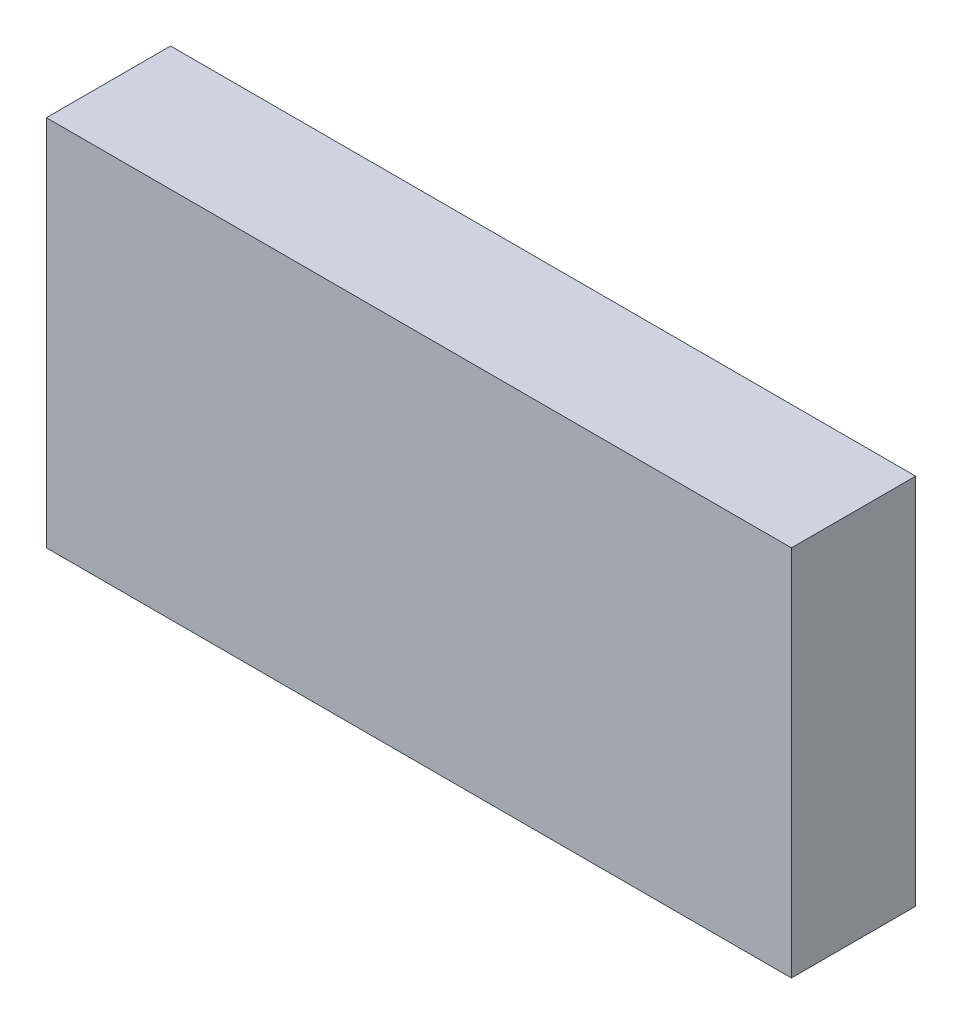
ISO-10303-21;
HEADER;
FILE_DESCRIPTION(('STEP AP214'),'2;1');
FILE_NAME('part.step','',(''),(''),'','','');
FILE_SCHEMA(('AUTOMOTIVE_DESIGN { 1 0 10303 214 1 1 1 1 }'));
ENDSEC;
DATA;
#1=APPLICATION_CONTEXT('core data for automotive mechanical design processes');
#2=APPLICATION_PROTOCOL_DEFINITION('international standard','automotive_design',2000,#1);
#3=PRODUCT_CONTEXT('',#1,'mechanical');
#4=PRODUCT('Part','Part','',(#3));
#5=PRODUCT_RELATED_PRODUCT_CATEGORY('part','',(#4));
#6=PRODUCT_DEFINITION_FORMATION('','',#4);
#7=PRODUCT_DEFINITION_CONTEXT('part definition',#1,'design');
#8=PRODUCT_DEFINITION('design','',#6,#7);
#9=PRODUCT_DEFINITION_SHAPE('','',#8);
#10=(LENGTH_UNIT() NAMED_UNIT(*) SI_UNIT(.MILLI.,.METRE.));
#11=(NAMED_UNIT(*) PLANE_ANGLE_UNIT() SI_UNIT($,.RADIAN.));
#12=(NAMED_UNIT(*) SI_UNIT($,.STERADIAN.) SOLID_ANGLE_UNIT());
#13=UNCERTAINTY_MEASURE_WITH_UNIT(LENGTH_MEASURE(1.E-05),#10,'distance_accuracy_value','');
#14=(GEOMETRIC_REPRESENTATION_CONTEXT(3) GLOBAL_UNCERTAINTY_ASSIGNED_CONTEXT((#13)) GLOBAL_UNIT_ASSIGNED_CONTEXT((#10,
#11,#12)) REPRESENTATION_CONTEXT('',''));
#15=CARTESIAN_POINT('',(0.,0.,0.));
#16=DIRECTION('',(0.,0.,1.));
#17=DIRECTION('',(1.,0.,0.));
#18=AXIS2_PLACEMENT_3D('',#15,#16,#17);
#19=CARTESIAN_POINT('',(3000.,-1500.,1000.));
#20=DIRECTION('',(0.,-1.,0.));
#21=DIRECTION('',(1.,0.,0.));
#22=AXIS2_PLACEMENT_3D('',#19,#20,#21);
#23=PLANE('',#22);
#24=DIRECTION('',(-1.,0.,0.));
#25=VECTOR('',#24,1.);
#26=CARTESIAN_POINT('',(3000.,-1500.,0.));
#27=LINE('',#26,#25);
#28=CARTESIAN_POINT('',(3000.,-1500.,0.));
#29=VERTEX_POINT('',#28);
#30=CARTESIAN_POINT('',(-3000.,-1500.,0.));
#31=VERTEX_POINT('',#30);
#32=EDGE_CURVE('E110',#29,#31,#27,.T.);
#33=ORIENTED_EDGE('',*,*,#32,.F.);
#34=DIRECTION('',(0.,0.,-1.));
#35=VECTOR('',#34,1.);
#36=CARTESIAN_POINT('',(3000.,-1500.,1000.));
#37=LINE('',#36,#35);
#38=CARTESIAN_POINT('',(3000.,-1500.,1000.));
#39=VERTEX_POINT('',#38);
#40=EDGE_CURVE('E11',#39,#29,#37,.T.);
#41=ORIENTED_EDGE('',*,*,#40,.F.);
#42=DIRECTION('',(-1.,0.,0.));
#43=VECTOR('',#42,1.);
#44=CARTESIAN_POINT('',(3000.,-1500.,1000.));
#45=LINE('',#44,#43);
#46=CARTESIAN_POINT('',(-3000.,-1500.,1000.));
#47=VERTEX_POINT('',#46);
#48=EDGE_CURVE('E103',#39,#47,#45,.T.);
#49=ORIENTED_EDGE('',*,*,#48,.T.);
#50=DIRECTION('',(0.,0.,-1.));
#51=VECTOR('',#50,1.);
#52=CARTESIAN_POINT('',(-3000.,-1500.,1000.));
#53=LINE('',#52,#51);
#54=EDGE_CURVE('E42',#47,#31,#53,.T.);
#55=ORIENTED_EDGE('',*,*,#54,.T.);
#56=EDGE_LOOP('',(#33,#41,#49,#55));
#57=FACE_BOUND('',#56,.T.);
#58=ADVANCED_FACE('F39',(#57),#23,.T.);
#59=CARTESIAN_POINT('',(3000.,-1500.,1000.));
#60=DIRECTION('',(-1.,0.,0.));
#61=DIRECTION('',(0.,-1.,0.));
#62=AXIS2_PLACEMENT_3D('',#59,#60,#61);
#63=PLANE('',#62);
#64=DIRECTION('',(0.,1.,0.));
#65=VECTOR('',#64,1.);
#66=CARTESIAN_POINT('',(3000.,-1500.,0.));
#67=LINE('',#66,#65);
#68=CARTESIAN_POINT('',(3000.,1500.,0.));
#69=VERTEX_POINT('',#68);
#70=EDGE_CURVE('E73',#29,#69,#67,.T.);
#71=ORIENTED_EDGE('',*,*,#70,.T.);
#72=DIRECTION('',(0.,0.,-1.));
#73=VECTOR('',#72,1.);
#74=CARTESIAN_POINT('',(3000.,1500.,1000.));
#75=LINE('',#74,#73);
#76=CARTESIAN_POINT('',(3000.,1500.,1000.));
#77=VERTEX_POINT('',#76);
#78=EDGE_CURVE('E49',#77,#69,#75,.T.);
#79=ORIENTED_EDGE('',*,*,#78,.F.);
#80=DIRECTION('',(0.,1.,0.));
#81=VECTOR('',#80,1.);
#82=CARTESIAN_POINT('',(3000.,-1500.,1000.));
#83=LINE('',#82,#81);
#84=EDGE_CURVE('E90',#39,#77,#83,.T.);
#85=ORIENTED_EDGE('',*,*,#84,.F.);
#86=ORIENTED_EDGE('',*,*,#40,.T.);
#87=EDGE_LOOP('',(#71,#79,#85,#86));
#88=FACE_BOUND('',#87,.T.);
#89=ADVANCED_FACE('F126',(#88),#63,.F.);
#90=CARTESIAN_POINT('',(3000.,1500.,1000.));
#91=DIRECTION('',(0.,-1.,0.));
#92=DIRECTION('',(1.,0.,0.));
#93=AXIS2_PLACEMENT_3D('',#90,#91,#92);
#94=PLANE('',#93);
#95=DIRECTION('',(-1.,0.,0.));
#96=VECTOR('',#95,1.);
#97=CARTESIAN_POINT('',(3000.,1500.,0.));
#98=LINE('',#97,#96);
#99=CARTESIAN_POINT('',(-3000.,1500.,0.));
#100=VERTEX_POINT('',#99);
#101=EDGE_CURVE('E98',#69,#100,#98,.T.);
#102=ORIENTED_EDGE('',*,*,#101,.T.);
#103=DIRECTION('',(0.,0.,-1.));
#104=VECTOR('',#103,1.);
#105=CARTESIAN_POINT('',(-3000.,1500.,1000.));
#106=LINE('',#105,#104);
#107=CARTESIAN_POINT('',(-3000.,1500.,1000.));
#108=VERTEX_POINT('',#107);
#109=EDGE_CURVE('E95',#108,#100,#106,.T.);
#110=ORIENTED_EDGE('',*,*,#109,.F.);
#111=DIRECTION('',(-1.,0.,0.));
#112=VECTOR('',#111,1.);
#113=CARTESIAN_POINT('',(3000.,1500.,1000.));
#114=LINE('',#113,#112);
#115=EDGE_CURVE('E85',#77,#108,#114,.T.);
#116=ORIENTED_EDGE('',*,*,#115,.F.);
#117=ORIENTED_EDGE('',*,*,#78,.T.);
#118=EDGE_LOOP('',(#102,#110,#116,#117));
#119=FACE_BOUND('',#118,.T.);
#120=ADVANCED_FACE('F96',(#119),#94,.F.);
#121=CARTESIAN_POINT('',(-3000.,-1500.,1000.));
#122=DIRECTION('',(-1.,0.,0.));
#123=DIRECTION('',(0.,0.,1.));
#124=AXIS2_PLACEMENT_3D('',#121,#122,#123);
#125=PLANE('',#124);
#126=DIRECTION('',(0.,1.,0.));
#127=VECTOR('',#126,1.);
#128=CARTESIAN_POINT('',(-3000.,-1500.,0.));
#129=LINE('',#128,#127);
#130=EDGE_CURVE('E114',#31,#100,#129,.T.);
#131=ORIENTED_EDGE('',*,*,#130,.F.);
#132=ORIENTED_EDGE('',*,*,#54,.F.);
#133=DIRECTION('',(0.,1.,0.));
#134=VECTOR('',#133,1.);
#135=CARTESIAN_POINT('',(-3000.,-1500.,1000.));
#136=LINE('',#135,#134);
#137=EDGE_CURVE('E89',#47,#108,#136,.T.);
#138=ORIENTED_EDGE('',*,*,#137,.T.);
#139=ORIENTED_EDGE('',*,*,#109,.T.);
#140=EDGE_LOOP('',(#131,#132,#138,#139));
#141=FACE_BOUND('',#140,.T.);
#142=ADVANCED_FACE('F101',(#141),#125,.T.);
#143=CARTESIAN_POINT('',(0.,0.,1000.));
#144=DIRECTION('',(0.,0.,-1.));
#145=DIRECTION('',(-1.,0.,0.));
#146=AXIS2_PLACEMENT_3D('',#143,#144,#145);
#147=PLANE('',#146);
#148=ORIENTED_EDGE('',*,*,#48,.F.);
#149=ORIENTED_EDGE('',*,*,#84,.T.);
#150=ORIENTED_EDGE('',*,*,#115,.T.);
#151=ORIENTED_EDGE('',*,*,#137,.F.);
#152=EDGE_LOOP('',(#148,#149,#150,#151));
#153=FACE_BOUND('',#152,.T.);
#154=ADVANCED_FACE('F88',(#153),#147,.F.);
#155=CARTESIAN_POINT('',(0.,0.,0.));
#156=DIRECTION('',(0.,0.,-1.));
#157=DIRECTION('',(-1.,0.,0.));
#158=AXIS2_PLACEMENT_3D('',#155,#156,#157);
#159=PLANE('',#158);
#160=ORIENTED_EDGE('',*,*,#32,.T.);
#161=ORIENTED_EDGE('',*,*,#130,.T.);
#162=ORIENTED_EDGE('',*,*,#101,.F.);
#163=ORIENTED_EDGE('',*,*,#70,.F.);
#164=EDGE_LOOP('',(#160,#161,#162,#163));
#165=FACE_BOUND('',#164,.T.);
#166=ADVANCED_FACE('F123',(#165),#159,.T.);
#167=CLOSED_SHELL('',(#58,#89,#120,#142,#154,#166));
#168=MANIFOLD_SOLID_BREP('B2',#167);
#169=ADVANCED_BREP_SHAPE_REPRESENTATION('',(#18,#168),#14);
#170=SHAPE_DEFINITION_REPRESENTATION(#9,#169);
ENDSEC;
END-ISO-10303-21;
